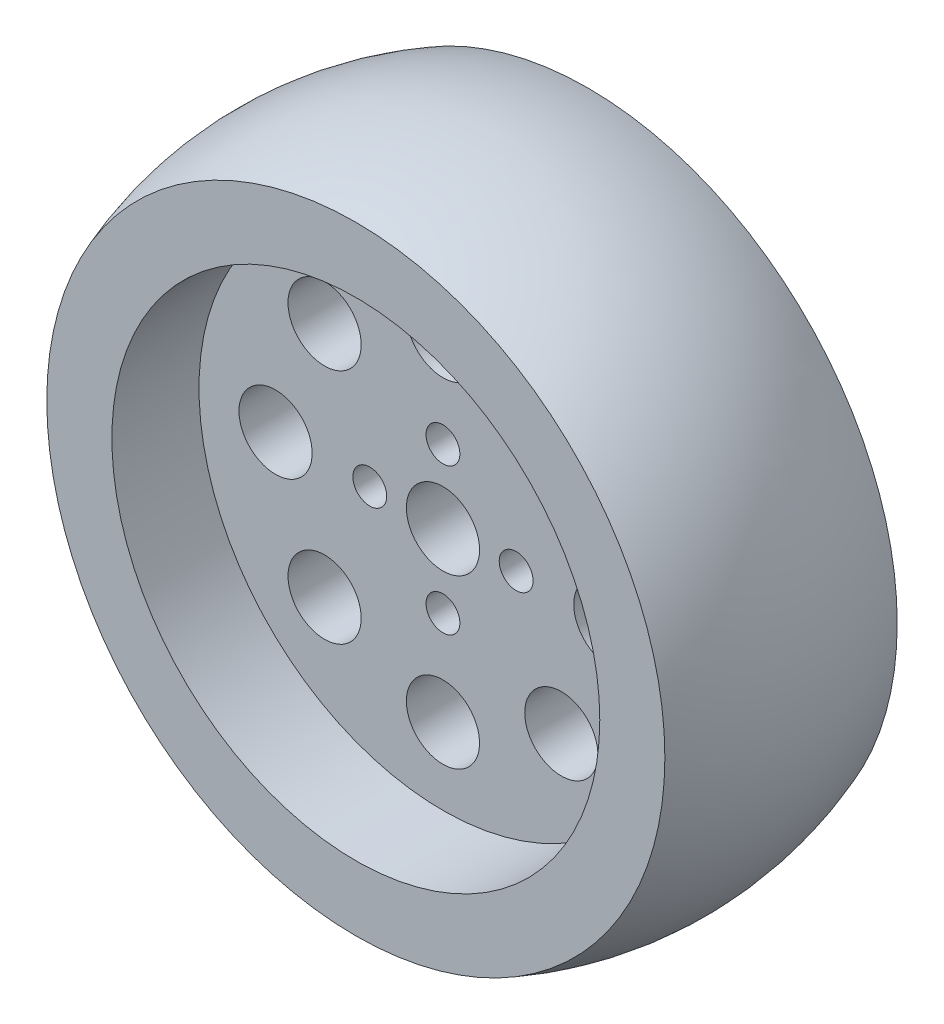
ISO-10303-21;
HEADER;
FILE_DESCRIPTION(('STEP AP214'),'2;1');
FILE_NAME('part.step','',(''),(''),'','','');
FILE_SCHEMA(('AUTOMOTIVE_DESIGN { 1 0 10303 214 1 1 1 1 }'));
ENDSEC;
DATA;
#1=APPLICATION_CONTEXT('core data for automotive mechanical design processes');
#2=APPLICATION_PROTOCOL_DEFINITION('international standard','automotive_design',2000,#1);
#3=PRODUCT_CONTEXT('',#1,'mechanical');
#4=PRODUCT('Part','Part','',(#3));
#5=PRODUCT_RELATED_PRODUCT_CATEGORY('part','',(#4));
#6=PRODUCT_DEFINITION_FORMATION('','',#4);
#7=PRODUCT_DEFINITION_CONTEXT('part definition',#1,'design');
#8=PRODUCT_DEFINITION('design','',#6,#7);
#9=PRODUCT_DEFINITION_SHAPE('','',#8);
#10=(LENGTH_UNIT() NAMED_UNIT(*) SI_UNIT(.MILLI.,.METRE.));
#11=(NAMED_UNIT(*) PLANE_ANGLE_UNIT() SI_UNIT($,.RADIAN.));
#12=(NAMED_UNIT(*) SI_UNIT($,.STERADIAN.) SOLID_ANGLE_UNIT());
#13=UNCERTAINTY_MEASURE_WITH_UNIT(LENGTH_MEASURE(1.E-05),#10,'distance_accuracy_value','');
#14=(GEOMETRIC_REPRESENTATION_CONTEXT(3) GLOBAL_UNCERTAINTY_ASSIGNED_CONTEXT((#13)) GLOBAL_UNIT_ASSIGNED_CONTEXT((#10,
#11,#12)) REPRESENTATION_CONTEXT('',''));
#15=CARTESIAN_POINT('',(0.,0.,0.));
#16=DIRECTION('',(0.,0.,1.));
#17=DIRECTION('',(1.,0.,0.));
#18=AXIS2_PLACEMENT_3D('',#15,#16,#17);
#19=CARTESIAN_POINT('',(1.12063407598645E-11,0.,-1.97150535193206E-12));
#20=DIRECTION('',(0.,0.,1.));
#21=DIRECTION('',(1.,0.,0.));
#22=AXIS2_PLACEMENT_3D('',#19,#20,#21);
#23=DEGENERATE_TOROIDAL_SURFACE('',#22,0.0999999999351139,36.0000000000639,.T.);
#24=CARTESIAN_POINT('',(1.12063136548102E-11,0.,-12.7000000000039));
#25=DIRECTION('',(0.,0.,1.));
#26=DIRECTION('',(1.,0.,0.));
#27=AXIS2_PLACEMENT_3D('',#24,#25,#26);
#28=CIRCLE('',#27,33.7854568026052);
#29=CARTESIAN_POINT('',(33.7854568026164,0.,-12.7000000000039));
#30=VERTEX_POINT('',#29);
#31=EDGE_CURVE('E10',#30,#30,#28,.T.);
#32=ORIENTED_EDGE('',*,*,#31,.T.);
#33=EDGE_LOOP('',(#32));
#34=FACE_BOUND('',#33,.T.);
#35=CARTESIAN_POINT('',(1.12063593945893E-11,0.,12.7));
#36=DIRECTION('',(0.,0.,1.));
#37=DIRECTION('',(1.,0.,0.));
#38=AXIS2_PLACEMENT_3D('',#35,#36,#37);
#39=CIRCLE('',#38,33.7854568026052);
#40=CARTESIAN_POINT('',(33.7854568026164,0.,12.7));
#41=VERTEX_POINT('',#40);
#42=EDGE_CURVE('E38',#41,#41,#39,.T.);
#43=ORIENTED_EDGE('',*,*,#42,.F.);
#44=EDGE_LOOP('',(#43));
#45=FACE_BOUND('',#44,.T.);
#46=ADVANCED_FACE('F32',(#34,#45),#23,.T.);
#47=CARTESIAN_POINT('',(33.7854568026164,0.,-12.7000000000039));
#48=DIRECTION('',(0.,0.,-1.));
#49=DIRECTION('',(-1.,0.,0.));
#50=AXIS2_PLACEMENT_3D('',#47,#48,#49);
#51=PLANE('',#50);
#52=CARTESIAN_POINT('',(0.,0.,-12.7));
#53=DIRECTION('',(0.,0.,1.));
#54=DIRECTION('',(1.,0.,0.));
#55=AXIS2_PLACEMENT_3D('',#52,#53,#54);
#56=CIRCLE('',#55,26.67);
#57=CARTESIAN_POINT('',(26.67,0.,-12.7));
#58=VERTEX_POINT('',#57);
#59=EDGE_CURVE('E42',#58,#58,#56,.T.);
#60=ORIENTED_EDGE('',*,*,#59,.T.);
#61=EDGE_LOOP('',(#60));
#62=FACE_BOUND('',#61,.T.);
#63=ORIENTED_EDGE('',*,*,#31,.F.);
#64=EDGE_LOOP('',(#63));
#65=FACE_BOUND('',#64,.T.);
#66=ADVANCED_FACE('F192',(#62,#65),#51,.T.);
#67=CARTESIAN_POINT('',(1.12063593945893E-11,0.,12.7));
#68=DIRECTION('',(0.,0.,1.));
#69=DIRECTION('',(1.,0.,0.));
#70=AXIS2_PLACEMENT_3D('',#67,#68,#69);
#71=PLANE('',#70);
#72=CARTESIAN_POINT('',(0.,0.,12.7));
#73=DIRECTION('',(0.,0.,1.));
#74=DIRECTION('',(1.,0.,0.));
#75=AXIS2_PLACEMENT_3D('',#72,#73,#74);
#76=CIRCLE('',#75,26.67);
#77=CARTESIAN_POINT('',(26.67,0.,12.7));
#78=VERTEX_POINT('',#77);
#79=EDGE_CURVE('E46',#78,#78,#76,.T.);
#80=ORIENTED_EDGE('',*,*,#79,.F.);
#81=EDGE_LOOP('',(#80));
#82=FACE_BOUND('',#81,.T.);
#83=ORIENTED_EDGE('',*,*,#42,.T.);
#84=EDGE_LOOP('',(#83));
#85=FACE_BOUND('',#84,.T.);
#86=ADVANCED_FACE('F190',(#82,#85),#71,.T.);
#87=CARTESIAN_POINT('',(0.,0.,-12.7));
#88=DIRECTION('',(0.,0.,1.));
#89=DIRECTION('',(1.,0.,0.));
#90=AXIS2_PLACEMENT_3D('',#87,#88,#89);
#91=CYLINDRICAL_SURFACE('',#90,26.67);
#92=ORIENTED_EDGE('',*,*,#59,.F.);
#93=EDGE_LOOP('',(#92));
#94=FACE_BOUND('',#93,.T.);
#95=CARTESIAN_POINT('',(0.,0.,-3.175));
#96=DIRECTION('',(0.,0.,1.));
#97=DIRECTION('',(1.,0.,0.));
#98=AXIS2_PLACEMENT_3D('',#95,#96,#97);
#99=CIRCLE('',#98,26.67);
#100=CARTESIAN_POINT('',(26.67,0.,-3.175));
#101=VERTEX_POINT('',#100);
#102=EDGE_CURVE('E60',#101,#101,#99,.T.);
#103=ORIENTED_EDGE('',*,*,#102,.T.);
#104=EDGE_LOOP('',(#103));
#105=FACE_BOUND('',#104,.T.);
#106=ADVANCED_FACE('F186',(#94,#105),#91,.F.);
#107=CARTESIAN_POINT('',(0.,0.,-12.7));
#108=DIRECTION('',(0.,0.,1.));
#109=DIRECTION('',(1.,0.,0.));
#110=AXIS2_PLACEMENT_3D('',#107,#108,#109);
#111=CYLINDRICAL_SURFACE('',#110,26.67);
#112=CARTESIAN_POINT('',(0.,0.,3.175));
#113=DIRECTION('',(0.,0.,1.));
#114=DIRECTION('',(1.,0.,0.));
#115=AXIS2_PLACEMENT_3D('',#112,#113,#114);
#116=CIRCLE('',#115,26.67);
#117=CARTESIAN_POINT('',(26.67,0.,3.175));
#118=VERTEX_POINT('',#117);
#119=EDGE_CURVE('E51',#118,#118,#116,.T.);
#120=ORIENTED_EDGE('',*,*,#119,.F.);
#121=EDGE_LOOP('',(#120));
#122=FACE_BOUND('',#121,.T.);
#123=ORIENTED_EDGE('',*,*,#79,.T.);
#124=EDGE_LOOP('',(#123));
#125=FACE_BOUND('',#124,.T.);
#126=ADVANCED_FACE('F179',(#122,#125),#111,.F.);
#127=CARTESIAN_POINT('',(26.67,0.,3.175));
#128=DIRECTION('',(0.,0.,-1.));
#129=DIRECTION('',(-1.,0.,0.));
#130=AXIS2_PLACEMENT_3D('',#127,#128,#129);
#131=PLANE('',#130);
#132=CARTESIAN_POINT('',(8.,0.,3.175));
#133=DIRECTION('',(0.,0.,-1.));
#134=DIRECTION('',(-1.,0.,0.));
#135=AXIS2_PLACEMENT_3D('',#132,#133,#134);
#136=CIRCLE('',#135,1.84999999999999);
#137=CARTESIAN_POINT('',(6.15000000000001,0.,3.175));
#138=VERTEX_POINT('',#137);
#139=EDGE_CURVE('E129',#138,#138,#136,.T.);
#140=ORIENTED_EDGE('',*,*,#139,.T.);
#141=EDGE_LOOP('',(#140));
#142=FACE_BOUND('',#141,.T.);
#143=CARTESIAN_POINT('',(0.,-8.,3.175));
#144=DIRECTION('',(0.,0.,-1.));
#145=DIRECTION('',(-1.,0.,0.));
#146=AXIS2_PLACEMENT_3D('',#143,#144,#145);
#147=CIRCLE('',#146,1.84999999999999);
#148=CARTESIAN_POINT('',(-1.84999999999999,-8.,3.175));
#149=VERTEX_POINT('',#148);
#150=EDGE_CURVE('E123',#149,#149,#147,.T.);
#151=ORIENTED_EDGE('',*,*,#150,.T.);
#152=EDGE_LOOP('',(#151));
#153=FACE_BOUND('',#152,.T.);
#154=CARTESIAN_POINT('',(-8.,0.,3.175));
#155=DIRECTION('',(0.,0.,-1.));
#156=DIRECTION('',(-1.,0.,0.));
#157=AXIS2_PLACEMENT_3D('',#154,#155,#156);
#158=CIRCLE('',#157,1.84999999999999);
#159=CARTESIAN_POINT('',(-9.84999999999999,0.,3.175));
#160=VERTEX_POINT('',#159);
#161=EDGE_CURVE('E117',#160,#160,#158,.T.);
#162=ORIENTED_EDGE('',*,*,#161,.T.);
#163=EDGE_LOOP('',(#162));
#164=FACE_BOUND('',#163,.T.);
#165=CARTESIAN_POINT('',(0.,8.,3.175));
#166=DIRECTION('',(0.,0.,-1.));
#167=DIRECTION('',(-1.,0.,0.));
#168=AXIS2_PLACEMENT_3D('',#165,#166,#167);
#169=CIRCLE('',#168,1.84999999999999);
#170=CARTESIAN_POINT('',(-1.84999999999999,8.,3.175));
#171=VERTEX_POINT('',#170);
#172=EDGE_CURVE('E111',#171,#171,#169,.T.);
#173=ORIENTED_EDGE('',*,*,#172,.T.);
#174=EDGE_LOOP('',(#173));
#175=FACE_BOUND('',#174,.T.);
#176=CARTESIAN_POINT('',(0.,-18.3,3.175));
#177=DIRECTION('',(0.,0.,-1.));
#178=DIRECTION('',(-1.,0.,0.));
#179=AXIS2_PLACEMENT_3D('',#176,#177,#178);
#180=CIRCLE('',#179,3.99999999999999);
#181=CARTESIAN_POINT('',(-3.99999999999999,-18.3,3.175));
#182=VERTEX_POINT('',#181);
#183=EDGE_CURVE('E105',#182,#182,#180,.T.);
#184=ORIENTED_EDGE('',*,*,#183,.T.);
#185=EDGE_LOOP('',(#184));
#186=FACE_BOUND('',#185,.T.);
#187=CARTESIAN_POINT('',(12.94005409571,-12.94005409571,3.175));
#188=DIRECTION('',(0.,0.,-1.));
#189=DIRECTION('',(-1.,0.,0.));
#190=AXIS2_PLACEMENT_3D('',#187,#188,#189);
#191=CIRCLE('',#190,3.99999999999999);
#192=CARTESIAN_POINT('',(8.94005409571001,-12.94005409571,3.175));
#193=VERTEX_POINT('',#192);
#194=EDGE_CURVE('E99',#193,#193,#191,.T.);
#195=ORIENTED_EDGE('',*,*,#194,.T.);
#196=EDGE_LOOP('',(#195));
#197=FACE_BOUND('',#196,.T.);
#198=CARTESIAN_POINT('',(18.3,0.,3.175));
#199=DIRECTION('',(0.,0.,-1.));
#200=DIRECTION('',(-1.,0.,0.));
#201=AXIS2_PLACEMENT_3D('',#198,#199,#200);
#202=CIRCLE('',#201,3.99999999999999);
#203=CARTESIAN_POINT('',(14.3,0.,3.175));
#204=VERTEX_POINT('',#203);
#205=EDGE_CURVE('E93',#204,#204,#202,.T.);
#206=ORIENTED_EDGE('',*,*,#205,.T.);
#207=EDGE_LOOP('',(#206));
#208=FACE_BOUND('',#207,.T.);
#209=CARTESIAN_POINT('',(12.94005409571,12.94005409571,3.175));
#210=DIRECTION('',(0.,0.,-1.));
#211=DIRECTION('',(-1.,0.,0.));
#212=AXIS2_PLACEMENT_3D('',#209,#210,#211);
#213=CIRCLE('',#212,3.99999999999999);
#214=CARTESIAN_POINT('',(8.94005409571001,12.94005409571,3.175));
#215=VERTEX_POINT('',#214);
#216=EDGE_CURVE('E87',#215,#215,#213,.T.);
#217=ORIENTED_EDGE('',*,*,#216,.T.);
#218=EDGE_LOOP('',(#217));
#219=FACE_BOUND('',#218,.T.);
#220=CARTESIAN_POINT('',(0.,18.3,3.175));
#221=DIRECTION('',(0.,0.,-1.));
#222=DIRECTION('',(-1.,0.,0.));
#223=AXIS2_PLACEMENT_3D('',#220,#221,#222);
#224=CIRCLE('',#223,3.99999999999999);
#225=CARTESIAN_POINT('',(-3.99999999999999,18.3,3.175));
#226=VERTEX_POINT('',#225);
#227=EDGE_CURVE('E81',#226,#226,#224,.T.);
#228=ORIENTED_EDGE('',*,*,#227,.T.);
#229=EDGE_LOOP('',(#228));
#230=FACE_BOUND('',#229,.T.);
#231=CARTESIAN_POINT('',(-12.94005409571,12.94005409571,3.175));
#232=DIRECTION('',(0.,0.,-1.));
#233=DIRECTION('',(-1.,0.,0.));
#234=AXIS2_PLACEMENT_3D('',#231,#232,#233);
#235=CIRCLE('',#234,3.99999999999999);
#236=CARTESIAN_POINT('',(-16.94005409571,12.94005409571,3.175));
#237=VERTEX_POINT('',#236);
#238=EDGE_CURVE('E75',#237,#237,#235,.T.);
#239=ORIENTED_EDGE('',*,*,#238,.T.);
#240=EDGE_LOOP('',(#239));
#241=FACE_BOUND('',#240,.T.);
#242=CARTESIAN_POINT('',(-18.3,0.,3.175));
#243=DIRECTION('',(0.,0.,-1.));
#244=DIRECTION('',(-1.,0.,0.));
#245=AXIS2_PLACEMENT_3D('',#242,#243,#244);
#246=CIRCLE('',#245,3.99999999999999);
#247=CARTESIAN_POINT('',(-22.3,0.,3.175));
#248=VERTEX_POINT('',#247);
#249=EDGE_CURVE('E69',#248,#248,#246,.T.);
#250=ORIENTED_EDGE('',*,*,#249,.T.);
#251=EDGE_LOOP('',(#250));
#252=FACE_BOUND('',#251,.T.);
#253=CARTESIAN_POINT('',(-12.94005409571,-12.94005409571,3.175));
#254=DIRECTION('',(0.,0.,-1.));
#255=DIRECTION('',(-1.,0.,0.));
#256=AXIS2_PLACEMENT_3D('',#253,#254,#255);
#257=CIRCLE('',#256,3.99999999999999);
#258=CARTESIAN_POINT('',(-16.94005409571,-12.94005409571,3.175));
#259=VERTEX_POINT('',#258);
#260=EDGE_CURVE('E63',#259,#259,#257,.T.);
#261=ORIENTED_EDGE('',*,*,#260,.T.);
#262=EDGE_LOOP('',(#261));
#263=FACE_BOUND('',#262,.T.);
#264=CARTESIAN_POINT('',(0.,0.,3.175));
#265=DIRECTION('',(0.,0.,1.));
#266=DIRECTION('',(1.,0.,0.));
#267=AXIS2_PLACEMENT_3D('',#264,#265,#266);
#268=CIRCLE('',#267,4.);
#269=CARTESIAN_POINT('',(4.,0.,3.175));
#270=VERTEX_POINT('',#269);
#271=EDGE_CURVE('E54',#270,#270,#268,.T.);
#272=ORIENTED_EDGE('',*,*,#271,.F.);
#273=EDGE_LOOP('',(#272));
#274=FACE_BOUND('',#273,.T.);
#275=ORIENTED_EDGE('',*,*,#119,.T.);
#276=EDGE_LOOP('',(#275));
#277=FACE_BOUND('',#276,.T.);
#278=ADVANCED_FACE('F173',(#142,#153,#164,#175,#186,#197,#208,#219,#230,#241,#252,#263,#274,
#277),#131,.F.);
#279=CARTESIAN_POINT('',(0.,0.,-12.7));
#280=DIRECTION('',(0.,0.,1.));
#281=DIRECTION('',(1.,0.,0.));
#282=AXIS2_PLACEMENT_3D('',#279,#280,#281);
#283=CYLINDRICAL_SURFACE('',#282,4.);
#284=CARTESIAN_POINT('',(0.,0.,-3.175));
#285=DIRECTION('',(0.,0.,1.));
#286=DIRECTION('',(1.,0.,0.));
#287=AXIS2_PLACEMENT_3D('',#284,#285,#286);
#288=CIRCLE('',#287,4.);
#289=CARTESIAN_POINT('',(4.,0.,-3.175));
#290=VERTEX_POINT('',#289);
#291=EDGE_CURVE('E57',#290,#290,#288,.T.);
#292=ORIENTED_EDGE('',*,*,#291,.F.);
#293=EDGE_LOOP('',(#292));
#294=FACE_BOUND('',#293,.T.);
#295=ORIENTED_EDGE('',*,*,#271,.T.);
#296=EDGE_LOOP('',(#295));
#297=FACE_BOUND('',#296,.T.);
#298=ADVANCED_FACE('F143',(#294,#297),#283,.F.);
#299=CARTESIAN_POINT('',(4.,0.,-3.175));
#300=DIRECTION('',(0.,0.,1.));
#301=DIRECTION('',(1.,0.,0.));
#302=AXIS2_PLACEMENT_3D('',#299,#300,#301);
#303=PLANE('',#302);
#304=CARTESIAN_POINT('',(8.,0.,-3.175));
#305=DIRECTION('',(0.,0.,-1.));
#306=DIRECTION('',(-1.,0.,0.));
#307=AXIS2_PLACEMENT_3D('',#304,#305,#306);
#308=CIRCLE('',#307,1.84999999999999);
#309=CARTESIAN_POINT('',(6.15000000000001,0.,-3.175));
#310=VERTEX_POINT('',#309);
#311=EDGE_CURVE('E132',#310,#310,#308,.T.);
#312=ORIENTED_EDGE('',*,*,#311,.F.);
#313=EDGE_LOOP('',(#312));
#314=FACE_BOUND('',#313,.T.);
#315=CARTESIAN_POINT('',(0.,-8.,-3.175));
#316=DIRECTION('',(0.,0.,-1.));
#317=DIRECTION('',(-1.,0.,0.));
#318=AXIS2_PLACEMENT_3D('',#315,#316,#317);
#319=CIRCLE('',#318,1.84999999999999);
#320=CARTESIAN_POINT('',(-1.84999999999999,-8.,-3.175));
#321=VERTEX_POINT('',#320);
#322=EDGE_CURVE('E126',#321,#321,#319,.T.);
#323=ORIENTED_EDGE('',*,*,#322,.F.);
#324=EDGE_LOOP('',(#323));
#325=FACE_BOUND('',#324,.T.);
#326=CARTESIAN_POINT('',(-8.,0.,-3.175));
#327=DIRECTION('',(0.,0.,-1.));
#328=DIRECTION('',(-1.,0.,0.));
#329=AXIS2_PLACEMENT_3D('',#326,#327,#328);
#330=CIRCLE('',#329,1.84999999999999);
#331=CARTESIAN_POINT('',(-9.84999999999999,0.,-3.175));
#332=VERTEX_POINT('',#331);
#333=EDGE_CURVE('E120',#332,#332,#330,.T.);
#334=ORIENTED_EDGE('',*,*,#333,.F.);
#335=EDGE_LOOP('',(#334));
#336=FACE_BOUND('',#335,.T.);
#337=CARTESIAN_POINT('',(0.,8.,-3.175));
#338=DIRECTION('',(0.,0.,-1.));
#339=DIRECTION('',(-1.,0.,0.));
#340=AXIS2_PLACEMENT_3D('',#337,#338,#339);
#341=CIRCLE('',#340,1.84999999999999);
#342=CARTESIAN_POINT('',(-1.84999999999999,8.,-3.175));
#343=VERTEX_POINT('',#342);
#344=EDGE_CURVE('E114',#343,#343,#341,.T.);
#345=ORIENTED_EDGE('',*,*,#344,.F.);
#346=EDGE_LOOP('',(#345));
#347=FACE_BOUND('',#346,.T.);
#348=CARTESIAN_POINT('',(0.,-18.3,-3.175));
#349=DIRECTION('',(0.,0.,-1.));
#350=DIRECTION('',(-1.,0.,0.));
#351=AXIS2_PLACEMENT_3D('',#348,#349,#350);
#352=CIRCLE('',#351,3.99999999999999);
#353=CARTESIAN_POINT('',(-3.99999999999999,-18.3,-3.175));
#354=VERTEX_POINT('',#353);
#355=EDGE_CURVE('E108',#354,#354,#352,.T.);
#356=ORIENTED_EDGE('',*,*,#355,.F.);
#357=EDGE_LOOP('',(#356));
#358=FACE_BOUND('',#357,.T.);
#359=CARTESIAN_POINT('',(12.94005409571,-12.94005409571,-3.175));
#360=DIRECTION('',(0.,0.,-1.));
#361=DIRECTION('',(-1.,0.,0.));
#362=AXIS2_PLACEMENT_3D('',#359,#360,#361);
#363=CIRCLE('',#362,3.99999999999999);
#364=CARTESIAN_POINT('',(8.94005409571001,-12.94005409571,-3.175));
#365=VERTEX_POINT('',#364);
#366=EDGE_CURVE('E102',#365,#365,#363,.T.);
#367=ORIENTED_EDGE('',*,*,#366,.F.);
#368=EDGE_LOOP('',(#367));
#369=FACE_BOUND('',#368,.T.);
#370=CARTESIAN_POINT('',(18.3,0.,-3.175));
#371=DIRECTION('',(0.,0.,-1.));
#372=DIRECTION('',(-1.,0.,0.));
#373=AXIS2_PLACEMENT_3D('',#370,#371,#372);
#374=CIRCLE('',#373,3.99999999999999);
#375=CARTESIAN_POINT('',(14.3,0.,-3.175));
#376=VERTEX_POINT('',#375);
#377=EDGE_CURVE('E96',#376,#376,#374,.T.);
#378=ORIENTED_EDGE('',*,*,#377,.F.);
#379=EDGE_LOOP('',(#378));
#380=FACE_BOUND('',#379,.T.);
#381=CARTESIAN_POINT('',(12.94005409571,12.94005409571,-3.175));
#382=DIRECTION('',(0.,0.,-1.));
#383=DIRECTION('',(-1.,0.,0.));
#384=AXIS2_PLACEMENT_3D('',#381,#382,#383);
#385=CIRCLE('',#384,3.99999999999999);
#386=CARTESIAN_POINT('',(8.94005409571001,12.94005409571,-3.175));
#387=VERTEX_POINT('',#386);
#388=EDGE_CURVE('E90',#387,#387,#385,.T.);
#389=ORIENTED_EDGE('',*,*,#388,.F.);
#390=EDGE_LOOP('',(#389));
#391=FACE_BOUND('',#390,.T.);
#392=CARTESIAN_POINT('',(0.,18.3,-3.175));
#393=DIRECTION('',(0.,0.,-1.));
#394=DIRECTION('',(-1.,0.,0.));
#395=AXIS2_PLACEMENT_3D('',#392,#393,#394);
#396=CIRCLE('',#395,3.99999999999999);
#397=CARTESIAN_POINT('',(-3.99999999999999,18.3,-3.175));
#398=VERTEX_POINT('',#397);
#399=EDGE_CURVE('E84',#398,#398,#396,.T.);
#400=ORIENTED_EDGE('',*,*,#399,.F.);
#401=EDGE_LOOP('',(#400));
#402=FACE_BOUND('',#401,.T.);
#403=CARTESIAN_POINT('',(-12.94005409571,12.94005409571,-3.175));
#404=DIRECTION('',(0.,0.,-1.));
#405=DIRECTION('',(-1.,0.,0.));
#406=AXIS2_PLACEMENT_3D('',#403,#404,#405);
#407=CIRCLE('',#406,3.99999999999999);
#408=CARTESIAN_POINT('',(-16.94005409571,12.94005409571,-3.175));
#409=VERTEX_POINT('',#408);
#410=EDGE_CURVE('E78',#409,#409,#407,.T.);
#411=ORIENTED_EDGE('',*,*,#410,.F.);
#412=EDGE_LOOP('',(#411));
#413=FACE_BOUND('',#412,.T.);
#414=CARTESIAN_POINT('',(-18.3,0.,-3.175));
#415=DIRECTION('',(0.,0.,-1.));
#416=DIRECTION('',(-1.,0.,0.));
#417=AXIS2_PLACEMENT_3D('',#414,#415,#416);
#418=CIRCLE('',#417,3.99999999999999);
#419=CARTESIAN_POINT('',(-22.3,0.,-3.175));
#420=VERTEX_POINT('',#419);
#421=EDGE_CURVE('E72',#420,#420,#418,.T.);
#422=ORIENTED_EDGE('',*,*,#421,.F.);
#423=EDGE_LOOP('',(#422));
#424=FACE_BOUND('',#423,.T.);
#425=CARTESIAN_POINT('',(-12.94005409571,-12.94005409571,-3.175));
#426=DIRECTION('',(0.,0.,-1.));
#427=DIRECTION('',(-1.,0.,0.));
#428=AXIS2_PLACEMENT_3D('',#425,#426,#427);
#429=CIRCLE('',#428,3.99999999999999);
#430=CARTESIAN_POINT('',(-16.94005409571,-12.94005409571,-3.175));
#431=VERTEX_POINT('',#430);
#432=EDGE_CURVE('E66',#431,#431,#429,.T.);
#433=ORIENTED_EDGE('',*,*,#432,.F.);
#434=EDGE_LOOP('',(#433));
#435=FACE_BOUND('',#434,.T.);
#436=ORIENTED_EDGE('',*,*,#102,.F.);
#437=EDGE_LOOP('',(#436));
#438=FACE_BOUND('',#437,.T.);
#439=ORIENTED_EDGE('',*,*,#291,.T.);
#440=EDGE_LOOP('',(#439));
#441=FACE_BOUND('',#440,.T.);
#442=ADVANCED_FACE('F139',(#314,#325,#336,#347,#358,#369,#380,#391,#402,#413,#424,#435,#438,
#441),#303,.F.);
#443=CARTESIAN_POINT('',(-12.94005409571,-12.94005409571,-3.175));
#444=DIRECTION('',(0.,0.,-1.));
#445=DIRECTION('',(-1.,0.,0.));
#446=AXIS2_PLACEMENT_3D('',#443,#444,#445);
#447=CYLINDRICAL_SURFACE('',#446,3.99999999999999);
#448=ORIENTED_EDGE('',*,*,#432,.T.);
#449=EDGE_LOOP('',(#448));
#450=FACE_BOUND('',#449,.T.);
#451=ORIENTED_EDGE('',*,*,#260,.F.);
#452=EDGE_LOOP('',(#451));
#453=FACE_BOUND('',#452,.T.);
#454=ADVANCED_FACE('F142',(#450,#453),#447,.F.);
#455=CARTESIAN_POINT('',(-18.3,0.,-3.175));
#456=DIRECTION('',(0.,0.,-1.));
#457=DIRECTION('',(-1.,0.,0.));
#458=AXIS2_PLACEMENT_3D('',#455,#456,#457);
#459=CYLINDRICAL_SURFACE('',#458,3.99999999999999);
#460=ORIENTED_EDGE('',*,*,#421,.T.);
#461=EDGE_LOOP('',(#460));
#462=FACE_BOUND('',#461,.T.);
#463=ORIENTED_EDGE('',*,*,#249,.F.);
#464=EDGE_LOOP('',(#463));
#465=FACE_BOUND('',#464,.T.);
#466=ADVANCED_FACE('F245',(#462,#465),#459,.F.);
#467=CARTESIAN_POINT('',(-12.94005409571,12.94005409571,-3.175));
#468=DIRECTION('',(0.,0.,-1.));
#469=DIRECTION('',(-1.,0.,0.));
#470=AXIS2_PLACEMENT_3D('',#467,#468,#469);
#471=CYLINDRICAL_SURFACE('',#470,3.99999999999999);
#472=ORIENTED_EDGE('',*,*,#410,.T.);
#473=EDGE_LOOP('',(#472));
#474=FACE_BOUND('',#473,.T.);
#475=ORIENTED_EDGE('',*,*,#238,.F.);
#476=EDGE_LOOP('',(#475));
#477=FACE_BOUND('',#476,.T.);
#478=ADVANCED_FACE('F255',(#474,#477),#471,.F.);
#479=CARTESIAN_POINT('',(0.,18.3,-3.175));
#480=DIRECTION('',(0.,0.,-1.));
#481=DIRECTION('',(-1.,0.,0.));
#482=AXIS2_PLACEMENT_3D('',#479,#480,#481);
#483=CYLINDRICAL_SURFACE('',#482,3.99999999999999);
#484=ORIENTED_EDGE('',*,*,#399,.T.);
#485=EDGE_LOOP('',(#484));
#486=FACE_BOUND('',#485,.T.);
#487=ORIENTED_EDGE('',*,*,#227,.F.);
#488=EDGE_LOOP('',(#487));
#489=FACE_BOUND('',#488,.T.);
#490=ADVANCED_FACE('F265',(#486,#489),#483,.F.);
#491=CARTESIAN_POINT('',(12.94005409571,12.94005409571,-3.175));
#492=DIRECTION('',(0.,0.,-1.));
#493=DIRECTION('',(-1.,0.,0.));
#494=AXIS2_PLACEMENT_3D('',#491,#492,#493);
#495=CYLINDRICAL_SURFACE('',#494,3.99999999999999);
#496=ORIENTED_EDGE('',*,*,#388,.T.);
#497=EDGE_LOOP('',(#496));
#498=FACE_BOUND('',#497,.T.);
#499=ORIENTED_EDGE('',*,*,#216,.F.);
#500=EDGE_LOOP('',(#499));
#501=FACE_BOUND('',#500,.T.);
#502=ADVANCED_FACE('F275',(#498,#501),#495,.F.);
#503=CARTESIAN_POINT('',(18.3,0.,-3.175));
#504=DIRECTION('',(0.,0.,-1.));
#505=DIRECTION('',(-1.,0.,0.));
#506=AXIS2_PLACEMENT_3D('',#503,#504,#505);
#507=CYLINDRICAL_SURFACE('',#506,3.99999999999999);
#508=ORIENTED_EDGE('',*,*,#377,.T.);
#509=EDGE_LOOP('',(#508));
#510=FACE_BOUND('',#509,.T.);
#511=ORIENTED_EDGE('',*,*,#205,.F.);
#512=EDGE_LOOP('',(#511));
#513=FACE_BOUND('',#512,.T.);
#514=ADVANCED_FACE('F285',(#510,#513),#507,.F.);
#515=CARTESIAN_POINT('',(12.94005409571,-12.94005409571,-3.175));
#516=DIRECTION('',(0.,0.,-1.));
#517=DIRECTION('',(-1.,0.,0.));
#518=AXIS2_PLACEMENT_3D('',#515,#516,#517);
#519=CYLINDRICAL_SURFACE('',#518,3.99999999999999);
#520=ORIENTED_EDGE('',*,*,#366,.T.);
#521=EDGE_LOOP('',(#520));
#522=FACE_BOUND('',#521,.T.);
#523=ORIENTED_EDGE('',*,*,#194,.F.);
#524=EDGE_LOOP('',(#523));
#525=FACE_BOUND('',#524,.T.);
#526=ADVANCED_FACE('F295',(#522,#525),#519,.F.);
#527=CARTESIAN_POINT('',(0.,-18.3,-3.175));
#528=DIRECTION('',(0.,0.,-1.));
#529=DIRECTION('',(-1.,0.,0.));
#530=AXIS2_PLACEMENT_3D('',#527,#528,#529);
#531=CYLINDRICAL_SURFACE('',#530,3.99999999999999);
#532=ORIENTED_EDGE('',*,*,#355,.T.);
#533=EDGE_LOOP('',(#532));
#534=FACE_BOUND('',#533,.T.);
#535=ORIENTED_EDGE('',*,*,#183,.F.);
#536=EDGE_LOOP('',(#535));
#537=FACE_BOUND('',#536,.T.);
#538=ADVANCED_FACE('F305',(#534,#537),#531,.F.);
#539=CARTESIAN_POINT('',(0.,8.,-3.175));
#540=DIRECTION('',(0.,0.,-1.));
#541=DIRECTION('',(-1.,0.,0.));
#542=AXIS2_PLACEMENT_3D('',#539,#540,#541);
#543=CYLINDRICAL_SURFACE('',#542,1.84999999999999);
#544=ORIENTED_EDGE('',*,*,#344,.T.);
#545=EDGE_LOOP('',(#544));
#546=FACE_BOUND('',#545,.T.);
#547=ORIENTED_EDGE('',*,*,#172,.F.);
#548=EDGE_LOOP('',(#547));
#549=FACE_BOUND('',#548,.T.);
#550=ADVANCED_FACE('F315',(#546,#549),#543,.F.);
#551=CARTESIAN_POINT('',(-8.,0.,-3.175));
#552=DIRECTION('',(0.,0.,-1.));
#553=DIRECTION('',(-1.,0.,0.));
#554=AXIS2_PLACEMENT_3D('',#551,#552,#553);
#555=CYLINDRICAL_SURFACE('',#554,1.84999999999999);
#556=ORIENTED_EDGE('',*,*,#333,.T.);
#557=EDGE_LOOP('',(#556));
#558=FACE_BOUND('',#557,.T.);
#559=ORIENTED_EDGE('',*,*,#161,.F.);
#560=EDGE_LOOP('',(#559));
#561=FACE_BOUND('',#560,.T.);
#562=ADVANCED_FACE('F335',(#558,#561),#555,.F.);
#563=CARTESIAN_POINT('',(0.,-8.,-3.175));
#564=DIRECTION('',(0.,0.,-1.));
#565=DIRECTION('',(-1.,0.,0.));
#566=AXIS2_PLACEMENT_3D('',#563,#564,#565);
#567=CYLINDRICAL_SURFACE('',#566,1.84999999999999);
#568=ORIENTED_EDGE('',*,*,#322,.T.);
#569=EDGE_LOOP('',(#568));
#570=FACE_BOUND('',#569,.T.);
#571=ORIENTED_EDGE('',*,*,#150,.F.);
#572=EDGE_LOOP('',(#571));
#573=FACE_BOUND('',#572,.T.);
#574=ADVANCED_FACE('F345',(#570,#573),#567,.F.);
#575=CARTESIAN_POINT('',(8.,0.,-3.175));
#576=DIRECTION('',(0.,0.,-1.));
#577=DIRECTION('',(-1.,0.,0.));
#578=AXIS2_PLACEMENT_3D('',#575,#576,#577);
#579=CYLINDRICAL_SURFACE('',#578,1.84999999999999);
#580=ORIENTED_EDGE('',*,*,#311,.T.);
#581=EDGE_LOOP('',(#580));
#582=FACE_BOUND('',#581,.T.);
#583=ORIENTED_EDGE('',*,*,#139,.F.);
#584=EDGE_LOOP('',(#583));
#585=FACE_BOUND('',#584,.T.);
#586=ADVANCED_FACE('F136',(#582,#585),#579,.F.);
#587=CLOSED_SHELL('',(#46,#66,#86,#106,#126,#278,#298,#442,#454,#466,#478,#490,#502,#514,#526,
#538,#550,#562,#574,#586));
#588=MANIFOLD_SOLID_BREP('B2',#587);
#589=ADVANCED_BREP_SHAPE_REPRESENTATION('',(#18,#588),#14);
#590=SHAPE_DEFINITION_REPRESENTATION(#9,#589);
ENDSEC;
END-ISO-10303-21;
